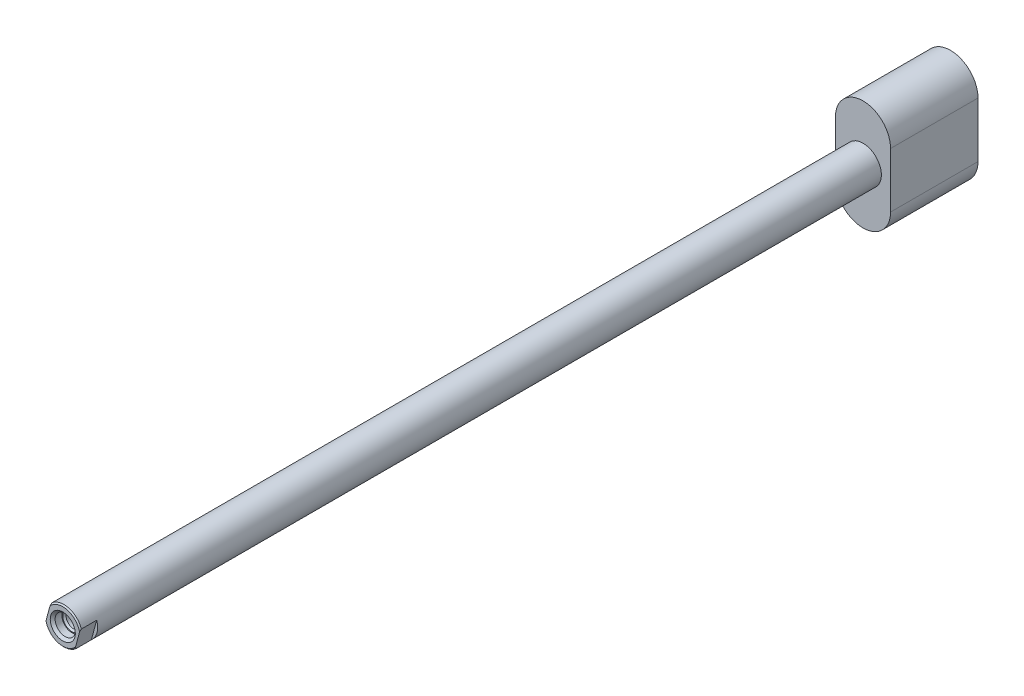
ISO-10303-21;
HEADER;
FILE_DESCRIPTION(('STEP AP214'),'2;1');
FILE_NAME('part.step','',(''),(''),'','','');
FILE_SCHEMA(('AUTOMOTIVE_DESIGN { 1 0 10303 214 1 1 1 1 }'));
ENDSEC;
DATA;
#1=APPLICATION_CONTEXT('core data for automotive mechanical design processes');
#2=APPLICATION_PROTOCOL_DEFINITION('international standard','automotive_design',2000,#1);
#3=PRODUCT_CONTEXT('',#1,'mechanical');
#4=PRODUCT('Part','Part','',(#3));
#5=PRODUCT_RELATED_PRODUCT_CATEGORY('part','',(#4));
#6=PRODUCT_DEFINITION_FORMATION('','',#4);
#7=PRODUCT_DEFINITION_CONTEXT('part definition',#1,'design');
#8=PRODUCT_DEFINITION('design','',#6,#7);
#9=PRODUCT_DEFINITION_SHAPE('','',#8);
#10=(LENGTH_UNIT() NAMED_UNIT(*) SI_UNIT(.MILLI.,.METRE.));
#11=(NAMED_UNIT(*) PLANE_ANGLE_UNIT() SI_UNIT($,.RADIAN.));
#12=(NAMED_UNIT(*) SI_UNIT($,.STERADIAN.) SOLID_ANGLE_UNIT());
#13=UNCERTAINTY_MEASURE_WITH_UNIT(LENGTH_MEASURE(1.E-05),#10,'distance_accuracy_value','');
#14=(GEOMETRIC_REPRESENTATION_CONTEXT(3) GLOBAL_UNCERTAINTY_ASSIGNED_CONTEXT((#13)) GLOBAL_UNIT_ASSIGNED_CONTEXT((#10,
#11,#12)) REPRESENTATION_CONTEXT('',''));
#15=CARTESIAN_POINT('',(0.,0.,0.));
#16=DIRECTION('',(0.,0.,1.));
#17=DIRECTION('',(1.,0.,0.));
#18=AXIS2_PLACEMENT_3D('',#15,#16,#17);
#19=CARTESIAN_POINT('',(0.,0.,7.));
#20=DIRECTION('',(0.,0.,1.));
#21=DIRECTION('',(1.,0.,0.));
#22=AXIS2_PLACEMENT_3D('',#19,#20,#21);
#23=PLANE('',#22);
#24=CARTESIAN_POINT('',(0.,0.,7.));
#25=DIRECTION('',(0.,0.,-1.));
#26=DIRECTION('',(-1.,0.,0.));
#27=AXIS2_PLACEMENT_3D('',#24,#25,#26);
#28=CIRCLE('',#27,2.05);
#29=CARTESIAN_POINT('',(-2.05,0.,7.));
#30=VERTEX_POINT('',#29);
#31=EDGE_CURVE('E217',#30,#30,#28,.T.);
#32=ORIENTED_EDGE('',*,*,#31,.T.);
#33=EDGE_LOOP('',(#32));
#34=FACE_BOUND('',#33,.T.);
#35=CARTESIAN_POINT('',(0.,0.,7.00000000000001));
#36=DIRECTION('',(0.,0.,-1.));
#37=DIRECTION('',(-1.,0.,0.));
#38=AXIS2_PLACEMENT_3D('',#35,#36,#37);
#39=CIRCLE('',#38,2.8);
#40=CARTESIAN_POINT('',(2.08845616765183,-1.8650337358335,7.00000000000001));
#41=VERTEX_POINT('',#40);
#42=CARTESIAN_POINT('',(-2.74117296379353,-0.570938510320872,7.00000000000001));
#43=VERTEX_POINT('',#42);
#44=EDGE_CURVE('E224',#41,#43,#39,.T.);
#45=ORIENTED_EDGE('',*,*,#44,.F.);
#46=DIRECTION('',(0.258819045102516,0.96592582628907,0.));
#47=VECTOR('',#46,1.);
#48=CARTESIAN_POINT('',(2.41481456572267,-0.647047612756289,7.));
#49=LINE('',#48,#47);
#50=CARTESIAN_POINT('',(2.74117296379352,0.570938510320919,7.00000000000001));
#51=VERTEX_POINT('',#50);
#52=EDGE_CURVE('E198',#41,#51,#49,.T.);
#53=ORIENTED_EDGE('',*,*,#52,.T.);
#54=CARTESIAN_POINT('',(-2.08845616765182,1.86503373583351,7.00000000000001));
#55=VERTEX_POINT('',#54);
#56=EDGE_CURVE('E225',#55,#51,#39,.T.);
#57=ORIENTED_EDGE('',*,*,#56,.F.);
#58=DIRECTION('',(-0.258819045102527,-0.965925826289067,0.));
#59=VECTOR('',#58,1.);
#60=CARTESIAN_POINT('',(-2.41481456572267,0.647047612756318,7.));
#61=LINE('',#60,#59);
#62=EDGE_CURVE('E169',#55,#43,#61,.T.);
#63=ORIENTED_EDGE('',*,*,#62,.T.);
#64=EDGE_LOOP('',(#45,#53,#57,#63));
#65=FACE_BOUND('',#64,.T.);
#66=ADVANCED_FACE('F38',(#34,#65),#23,.T.);
#67=CARTESIAN_POINT('',(0.,0.,6.8));
#68=DIRECTION('',(0.,0.,-1.));
#69=DIRECTION('',(-1.,0.,0.));
#70=AXIS2_PLACEMENT_3D('',#67,#68,#69);
#71=CONICAL_SURFACE('',#70,3.,0.785398163397434);
#72=CARTESIAN_POINT('',(0.,0.,6.8));
#73=DIRECTION('',(0.,0.,-1.));
#74=DIRECTION('',(-1.,0.,0.));
#75=AXIS2_PLACEMENT_3D('',#72,#73,#74);
#76=CIRCLE('',#75,3.);
#77=CARTESIAN_POINT('',(1.98561173512111,-2.24885438331372,6.8));
#78=VERTEX_POINT('',#77);
#79=CARTESIAN_POINT('',(-2.84401739632425,-0.954759157801095,6.8));
#80=VERTEX_POINT('',#79);
#81=EDGE_CURVE('E220',#78,#80,#76,.T.);
#82=ORIENTED_EDGE('',*,*,#81,.F.);
#83=CARTESIAN_POINT('',(0.789141781179332,-6.71414104115412,3.03964241542546));
#84=CARTESIAN_POINT('',(0.838397517213514,-6.53031613171035,3.21640923359223));
#85=CARTESIAN_POINT('',(0.887783419505345,-6.3460054351796,3.39264257243609));
#86=CARTESIAN_POINT('',(0.986935495776662,-5.97596484885909,3.74358903229317));
#87=CARTESIAN_POINT('',(1.03670175133417,-5.790234654616,3.91830180895357));
#88=CARTESIAN_POINT('',(1.13702323850811,-5.41582976739199,4.26675358800921));
#89=CARTESIAN_POINT('',(1.18758145010516,-5.22714395297196,4.44047981242431));
#90=CARTESIAN_POINT('',(1.289350829023,-4.84733546019587,4.78501639471897));
#91=CARTESIAN_POINT('',(1.34056191665286,-4.65621307925037,4.95582710262882));
#92=CARTESIAN_POINT('',(1.43343554839668,-4.30960396689897,5.25905373681237));
#93=CARTESIAN_POINT('',(1.47492998271965,-4.15474462977432,5.39223558142514));
#94=CARTESIAN_POINT('',(1.55871782857579,-3.84204413198246,5.65489065982897));
#95=CARTESIAN_POINT('',(1.60101143922773,-3.68420222819387,5.78436294859514));
#96=CARTESIAN_POINT('',(1.68662395520783,-3.36469196879233,6.03775455912755));
#97=CARTESIAN_POINT('',(1.72994143454289,-3.20302893505806,6.1616809802294));
#98=CARTESIAN_POINT('',(1.79603744638248,-2.95635526069505,6.34136253750564));
#99=CARTESIAN_POINT('',(1.81825182234145,-2.8734500809577,6.4002112827069));
#100=CARTESIAN_POINT('',(1.86312841307552,-2.70596836426768,6.51529392508184));
#101=CARTESIAN_POINT('',(1.88579057432912,-2.62139202705996,6.57152813209603));
#102=CARTESIAN_POINT('',(1.93037492634035,-2.45500096013149,6.67765541513886));
#103=CARTESIAN_POINT('',(1.95226847922813,-2.37329310839611,6.72772720282106));
#104=CARTESIAN_POINT('',(1.99660188832648,-2.20783857316833,6.82410409391317));
#105=CARTESIAN_POINT('',(2.01904162123841,-2.1240923498327,6.87041003739094));
#106=CARTESIAN_POINT('',(2.06454017836192,-1.95428942297671,6.95820900147921));
#107=CARTESIAN_POINT('',(2.08759881219084,-1.86823342997406,6.99970348173362));
#108=CARTESIAN_POINT('',(2.13439574554934,-1.69358489704169,7.0765488922833));
#109=CARTESIAN_POINT('',(2.15813386084004,-1.60499304470088,7.11190146989363));
#110=CARTESIAN_POINT('',(2.2011134687884,-1.4445909641482,7.16807570100878));
#111=CARTESIAN_POINT('',(2.22022374423078,-1.3732704452506,7.19038724798994));
#112=CARTESIAN_POINT('',(2.25882310811057,-1.2292156581114,7.22938161628565));
#113=CARTESIAN_POINT('',(2.27831205257995,-1.15648192716575,7.24606653418168));
#114=CARTESIAN_POINT('',(2.31752447971826,-1.01013915679749,7.27299258471795));
#115=CARTESIAN_POINT('',(2.33724698812957,-0.936533753353795,7.28325459129994));
#116=CARTESIAN_POINT('',(2.37685265169716,-0.788723404652068,7.29686018342851));
#117=CARTESIAN_POINT('',(2.39673579652218,-0.714518497950846,7.30020421040174));
#118=CARTESIAN_POINT('',(2.43656165425419,-0.565886373439954,7.29977570762936));
#119=CARTESIAN_POINT('',(2.45650435044684,-0.491459218009062,7.29597998357619));
#120=CARTESIAN_POINT('',(2.49621829518581,-0.343244758474241,7.28145171601451));
#121=CARTESIAN_POINT('',(2.51598953040683,-0.269457504101012,7.27071863817115));
#122=CARTESIAN_POINT('',(2.55528788473654,-0.122794049088692,7.24285670280215));
#123=CARTESIAN_POINT('',(2.57481403908634,-0.0499214489787897,7.22570781171165));
#124=CARTESIAN_POINT('',(2.61347429336991,0.0943605842410244,7.18581354261193));
#125=CARTESIAN_POINT('',(2.63260837131049,0.165769935271238,7.1630678515809));
#126=CARTESIAN_POINT('',(2.6929491629719,0.390964835520553,7.08297957029656));
#127=CARTESIAN_POINT('',(2.73335702317498,0.541769022823605,7.01665147928317));
#128=CARTESIAN_POINT('',(2.81230341121237,0.836400954053188,6.86900675029796));
#129=CARTESIAN_POINT('',(2.85083803097216,0.980214112847082,6.78766034416172));
#130=CARTESIAN_POINT('',(2.92687698758543,1.26399536228234,6.61407653249033));
#131=CARTESIAN_POINT('',(2.96436171622465,1.40389027407184,6.52171258296883));
#132=CARTESIAN_POINT('',(3.03811249392869,1.67913192356105,6.33034532729569));
#133=CARTESIAN_POINT('',(3.07437960764994,1.81448263461261,6.2313480607834));
#134=CARTESIAN_POINT('',(3.15275526086664,2.10698455449374,6.00965769149262));
#135=CARTESIAN_POINT('',(3.19468122764531,2.26345439266819,5.88600688495277));
#136=CARTESIAN_POINT('',(3.27762989665291,2.57302303982477,5.63424527012019));
#137=CARTESIAN_POINT('',(3.31865245019872,2.72612129391395,5.50613373650783));
#138=CARTESIAN_POINT('',(3.40006333729751,3.02995086085589,5.24663457785289));
#139=CARTESIAN_POINT('',(3.44045100278819,3.18067968046623,5.11524383513361));
#140=CARTESIAN_POINT('',(3.52071571438991,3.48023166221869,4.85015280105799));
#141=CARTESIAN_POINT('',(3.5605927464918,3.62905477207801,4.71645244657325));
#142=CARTESIAN_POINT('',(3.63752944144516,3.91618642661041,4.45552729076419));
#143=CARTESIAN_POINT('',(3.67461251147061,4.05458232804602,4.32840531548355));
#144=CARTESIAN_POINT('',(3.74850086297947,4.3303374099646,4.07295676813054));
#145=CARTESIAN_POINT('',(3.78530613817051,4.4676965669641,3.94463016891887));
#146=CARTESIAN_POINT('',(3.85861303546447,4.74128163221039,3.68729647622875));
#147=CARTESIAN_POINT('',(3.89511513888303,4.87750933675159,3.55829142712567));
#148=CARTESIAN_POINT('',(3.96793184525992,5.14926498458997,3.29950659839391));
#149=CARTESIAN_POINT('',(4.00424645688661,5.28479296023793,3.16972685519101));
#150=CARTESIAN_POINT('',(4.04048735026601,5.42004581564154,3.03964241542546));
#151=B_SPLINE_CURVE_WITH_KNOTS('',3,(#83,#84,#85,#86,#87,#88,#89,#90,#91,#92,#93,#94,#95,#96,
#97,#98,#99,#100,#101,#102,#103,#104,#105,#106,#107,#108,#109,#110,#111,#112,#113,#114,#115,
#116,#117,#118,#119,#120,#121,#122,#123,#124,#125,#126,#127,#128,#129,#130,#131,#132,#133,#134,
#135,#136,#137,#138,#139,#140,#141,#142,#143,#144,#145,#146,#147,#148,#149,#150),.UNSPECIFIED.,
.F.,.F.,(4,2,2,2,2,2,2,2,2,2,2,2,2,2,2,2,2,2,2,2,2,2,2,2,2,2,2,2,2,2,2,2,2,4),(0.,
0.779223553856486,1.55861920750734,2.34285322232984,3.12699241197525,3.75222332878767,
4.37761213453372,5.00217602568833,5.31434120448593,5.62646929480658,5.92129167276348,
6.21604810161056,6.5107148755434,6.80530249470207,7.03651785485177,7.2676469646278,
7.49802096909811,7.72838027327083,7.95948921901828,8.19061596756039,8.42247052276505,
8.65433804824393,9.16182646559973,9.67033180325825,10.1853729811453,10.6999514239144,
11.3112003235981,11.9225490815444,12.5345030562137,13.1464737839155,13.7210934160895,
14.2957260252404,14.8691287182088,15.4425046591184),.UNSPECIFIED.);
#152=EDGE_CURVE('E199',#78,#41,#151,.T.);
#153=ORIENTED_EDGE('',*,*,#152,.T.);
#154=ORIENTED_EDGE('',*,*,#44,.T.);
#155=CARTESIAN_POINT('',(-0.80005872580309,6.6733984491546,3.07881403129521));
#156=CARTESIAN_POINT('',(-0.848858475223293,6.49127530492178,3.2537821794811));
#157=CARTESIAN_POINT('',(-0.89778834497944,6.30866654498411,3.42821655912551));
#158=CARTESIAN_POINT('',(-0.996027348016984,5.9420335943631,3.7755666105796));
#159=CARTESIAN_POINT('',(-1.04533656240787,5.75800910097502,3.9484819396538));
#160=CARTESIAN_POINT('',(-1.14473442987697,5.38705120941634,4.29331483969953));
#161=CARTESIAN_POINT('',(-1.19482600380679,5.20010691047918,4.46521987141103));
#162=CARTESIAN_POINT('',(-1.29565879161439,4.82379382331239,4.80612579108504));
#163=CARTESIAN_POINT('',(-1.34639992716168,4.63442532741616,4.9751270235652));
#164=CARTESIAN_POINT('',(-1.4384339458764,4.29094969354812,5.27515910185036));
#165=CARTESIAN_POINT('',(-1.47956009465234,4.13746481679666,5.40695076060845));
#166=CARTESIAN_POINT('',(-1.56260426808076,3.82753974228925,5.66685069452284));
#167=CARTESIAN_POINT('',(-1.6045224861725,3.67109882260813,5.79495805011819));
#168=CARTESIAN_POINT('',(-1.68937539761451,3.35442344593641,6.04567815006513));
#169=CARTESIAN_POINT('',(-1.73230874313051,3.19419401913178,6.16829761666827));
#170=CARTESIAN_POINT('',(-1.79781336187915,2.94972745383143,6.34609438871697));
#171=CARTESIAN_POINT('',(-1.81982820787434,2.86756693005661,6.40432781871428));
#172=CARTESIAN_POINT('',(-1.86429887659626,2.70160013493982,6.51821651503946));
#173=CARTESIAN_POINT('',(-1.88675464782181,2.61779405580294,6.57387207994775));
#174=CARTESIAN_POINT('',(-1.93115502434801,2.45208959473198,6.6794638844525));
#175=CARTESIAN_POINT('',(-1.95307641278399,2.37027785931643,6.729545126368));
#176=CARTESIAN_POINT('',(-1.99746752455282,2.20460797479071,6.82592198882995));
#177=CARTESIAN_POINT('',(-2.01993712342139,2.1207502901875,6.87221845846527));
#178=CARTESIAN_POINT('',(-2.06549670951452,1.95071960011616,6.95997115365653));
#179=CARTESIAN_POINT('',(-2.08858648109264,1.86454739945145,7.00142903555533));
#180=CARTESIAN_POINT('',(-2.13544748141365,1.68965976535992,7.07816776522391));
#181=CARTESIAN_POINT('',(-2.159218522204,1.60094503338156,7.11345029795337));
#182=CARTESIAN_POINT('',(-2.2022187696218,1.4404659252803,7.1694121117036));
#183=CARTESIAN_POINT('',(-2.22131576562091,1.3691949659397,7.19159906912916));
#184=CARTESIAN_POINT('',(-2.25988658787187,1.2252466976094,7.2303412484838));
#185=CARTESIAN_POINT('',(-2.27936027092931,1.15256992302856,7.24689856767324));
#186=CARTESIAN_POINT('',(-2.3185400548824,1.00634897868606,7.2735721121564));
#187=CARTESIAN_POINT('',(-2.33824519727922,0.932808386090734,7.28370905111433));
#188=CARTESIAN_POINT('',(-2.37781323757585,0.785138449347792,7.29707303273412));
#189=CARTESIAN_POINT('',(-2.39767612556128,0.711009142201099,7.30030050626224));
#190=CARTESIAN_POINT('',(-2.43745643050283,0.56254702301866,7.2996542856907));
#191=CARTESIAN_POINT('',(-2.45737382303226,0.488214302144535,7.29575828164155));
#192=CARTESIAN_POINT('',(-2.49703540751257,0.340195253755343,7.28105217232633));
#193=CARTESIAN_POINT('',(-2.51677958590858,0.266508976827733,7.27024153076257));
#194=CARTESIAN_POINT('',(-2.55602295180507,0.120050741442031,7.24224887096265));
#195=CARTESIAN_POINT('',(-2.57552117445214,0.0472823838658622,7.22504693760949));
#196=CARTESIAN_POINT('',(-2.61412580291196,-0.0967920509534981,7.18506992728901));
#197=CARTESIAN_POINT('',(-2.63323218775076,-0.168098049920882,7.16229455283105));
#198=CARTESIAN_POINT('',(-2.69364981007442,-0.393579686105261,7.08192630964776));
#199=CARTESIAN_POINT('',(-2.73415587249319,-0.544750369066651,7.01529684974855));
#200=CARTESIAN_POINT('',(-2.81329112558873,-0.840087154289045,6.86701630221313));
#201=CARTESIAN_POINT('',(-2.85191637166261,-0.984238535091609,6.78533522923649));
#202=CARTESIAN_POINT('',(-2.92813096616304,-1.26867527404545,6.61107172871542));
#203=CARTESIAN_POINT('',(-2.96570075513789,-1.40888763532925,6.51836327008227));
#204=CARTESIAN_POINT('',(-3.03961947625018,-1.6847560581508,6.32630533036219));
#205=CARTESIAN_POINT('',(-3.07596947895719,-1.82041611510862,6.22696191445466));
#206=CARTESIAN_POINT('',(-3.15379814592717,-2.11087665452594,6.0065724938841));
#207=CARTESIAN_POINT('',(-3.19511521803658,-2.26507406685827,5.88467982088621));
#208=CARTESIAN_POINT('',(-3.27687112592502,-2.57019126891681,5.63655801544816));
#209=CARTESIAN_POINT('',(-3.31730982397866,-2.72111054464497,5.51032821086142));
#210=CARTESIAN_POINT('',(-3.3975675770924,-3.02063655696672,5.25467103617285));
#211=CARTESIAN_POINT('',(-3.43738599686865,-3.16924092264879,5.12524069936245));
#212=CARTESIAN_POINT('',(-3.51652270278561,-3.46458312987454,4.86411583822898));
#213=CARTESIAN_POINT('',(-3.55584097558139,-3.61132092161422,4.73242125371074));
#214=CARTESIAN_POINT('',(-3.63174645330963,-3.89460402106881,4.47525935391749));
#215=CARTESIAN_POINT('',(-3.66835622799293,-4.03123356024053,4.3498912902552));
#216=CARTESIAN_POINT('',(-3.74130160842774,-4.30346942620068,4.09796527789533));
#217=CARTESIAN_POINT('',(-3.7776372082238,-4.43907573076306,3.97140730348461));
#218=CARTESIAN_POINT('',(-3.85001036299173,-4.709176021461,3.71760962990355));
#219=CARTESIAN_POINT('',(-3.88604838117659,-4.84367173633097,3.59037190023107));
#220=CARTESIAN_POINT('',(-3.95793878346893,-5.11197037026255,3.33512833107673));
#221=CARTESIAN_POINT('',(-3.99379117596579,-5.24577332063372,3.20712252688266));
#222=CARTESIAN_POINT('',(-4.02957040564224,-5.37930322364193,3.07881403129525));
#223=B_SPLINE_CURVE_WITH_KNOTS('',3,(#155,#156,#157,#158,#159,#160,#161,#162,#163,#164,#165,
#166,#167,#168,#169,#170,#171,#172,#173,#174,#175,#176,#177,#178,#179,#180,#181,#182,#183,#184,
#185,#186,#187,#188,#189,#190,#191,#192,#193,#194,#195,#196,#197,#198,#199,#200,#201,#202,#203,
#204,#205,#206,#207,#208,#209,#210,#211,#212,#213,#214,#215,#216,#217,#218,#219,#220,#221,#222),
.UNSPECIFIED.,.F.,.F.,(4,2,2,2,2,2,2,2,2,2,2,2,2,2,2,2,2,2,2,2,2,2,2,2,2,2,2,2,2,2,2,2,2,4),(0.,
0.771678771001828,1.54352739700443,2.32008895704142,3.09655773768907,3.71584043587386,
4.33527638182,4.95393154806733,5.26314605371531,5.57232465466761,5.86743848396912,
6.16248592368375,6.45743206481728,6.7522976032629,6.98325736525403,7.21413099118761,
7.4442559183441,7.67436649475811,7.90519898704662,8.13604938482119,8.36762522353221,
8.59921342564175,9.10809714100835,9.61800581869265,10.1344341735543,10.6503967442365,
11.2528414403787,11.8553799252216,12.4584995754038,13.0616352844315,13.6286593669099,
14.1956957306761,14.7615507962676,15.3273800607446),.UNSPECIFIED.);
#224=EDGE_CURVE('E161',#43,#80,#223,.T.);
#225=ORIENTED_EDGE('',*,*,#224,.T.);
#226=EDGE_LOOP('',(#82,#153,#154,#225));
#227=FACE_BOUND('',#226,.T.);
#228=ADVANCED_FACE('F172',(#227),#71,.T.);
#229=ORIENTED_EDGE('',*,*,#56,.T.);
#230=CARTESIAN_POINT('',(2.84401739632423,0.954759157801142,6.8));
#231=VERTEX_POINT('',#230);
#232=EDGE_CURVE('E191',#51,#231,#151,.T.);
#233=ORIENTED_EDGE('',*,*,#232,.T.);
#234=CARTESIAN_POINT('',(-1.9856117351211,2.24885438331373,6.8));
#235=VERTEX_POINT('',#234);
#236=EDGE_CURVE('E221',#235,#231,#76,.T.);
#237=ORIENTED_EDGE('',*,*,#236,.F.);
#238=EDGE_CURVE('E170',#235,#55,#223,.T.);
#239=ORIENTED_EDGE('',*,*,#238,.T.);
#240=EDGE_LOOP('',(#229,#233,#237,#239));
#241=FACE_BOUND('',#240,.T.);
#242=ADVANCED_FACE('F247',(#241),#71,.T.);
#243=CARTESIAN_POINT('',(0.,0.,-138.15));
#244=DIRECTION('',(0.,0.,-1.));
#245=DIRECTION('',(-1.,0.,0.));
#246=AXIS2_PLACEMENT_3D('',#243,#244,#245);
#247=CYLINDRICAL_SURFACE('',#246,3.);
#248=CARTESIAN_POINT('',(0.,0.,-123.85));
#249=DIRECTION('',(0.,0.,1.));
#250=DIRECTION('',(1.,0.,0.));
#251=AXIS2_PLACEMENT_3D('',#248,#249,#250);
#252=CIRCLE('',#251,3.);
#253=CARTESIAN_POINT('',(3.,0.,-123.85));
#254=VERTEX_POINT('',#253);
#255=EDGE_CURVE('E11',#254,#254,#252,.F.);
#256=ORIENTED_EDGE('',*,*,#255,.F.);
#257=EDGE_LOOP('',(#256));
#258=FACE_BOUND('',#257,.T.);
#259=CARTESIAN_POINT('',(0.,0.,4.3));
#260=DIRECTION('',(0.,0.,1.));
#261=DIRECTION('',(1.,0.,0.));
#262=AXIS2_PLACEMENT_3D('',#259,#260,#261);
#263=CIRCLE('',#262,3.);
#264=CARTESIAN_POINT('',(-2.84401739632425,-0.954759157801097,4.3));
#265=VERTEX_POINT('',#264);
#266=CARTESIAN_POINT('',(-1.9856117351211,2.24885438331373,4.3));
#267=VERTEX_POINT('',#266);
#268=EDGE_CURVE('E232',#265,#267,#263,.F.);
#269=ORIENTED_EDGE('',*,*,#268,.T.);
#270=DIRECTION('',(0.,0.,-1.));
#271=VECTOR('',#270,1.);
#272=CARTESIAN_POINT('',(-1.9856117351211,2.24885438331373,-138.15));
#273=LINE('',#272,#271);
#274=EDGE_CURVE('E45',#267,#235,#273,.F.);
#275=ORIENTED_EDGE('',*,*,#274,.T.);
#276=ORIENTED_EDGE('',*,*,#236,.T.);
#277=DIRECTION('',(0.,0.,-1.));
#278=VECTOR('',#277,1.);
#279=CARTESIAN_POINT('',(2.84401739632423,0.954759157801142,-138.15));
#280=LINE('',#279,#278);
#281=CARTESIAN_POINT('',(2.84401739632423,0.954759157801142,4.3));
#282=VERTEX_POINT('',#281);
#283=EDGE_CURVE('E231',#231,#282,#280,.T.);
#284=ORIENTED_EDGE('',*,*,#283,.T.);
#285=CARTESIAN_POINT('',(1.98561173512111,-2.24885438331372,4.3));
#286=VERTEX_POINT('',#285);
#287=EDGE_CURVE('E228',#282,#286,#263,.F.);
#288=ORIENTED_EDGE('',*,*,#287,.T.);
#289=DIRECTION('',(0.,0.,-1.));
#290=VECTOR('',#289,1.);
#291=CARTESIAN_POINT('',(1.98561173512111,-2.24885438331372,-138.15));
#292=LINE('',#291,#290);
#293=EDGE_CURVE('E235',#286,#78,#292,.F.);
#294=ORIENTED_EDGE('',*,*,#293,.T.);
#295=ORIENTED_EDGE('',*,*,#81,.T.);
#296=DIRECTION('',(0.,0.,-1.));
#297=VECTOR('',#296,1.);
#298=CARTESIAN_POINT('',(-2.84401739632425,-0.954759157801095,-138.15));
#299=LINE('',#298,#297);
#300=EDGE_CURVE('E238',#80,#265,#299,.T.);
#301=ORIENTED_EDGE('',*,*,#300,.T.);
#302=EDGE_LOOP('',(#269,#275,#276,#284,#288,#294,#295,#301));
#303=FACE_BOUND('',#302,.T.);
#304=ADVANCED_FACE('F244',(#258,#303),#247,.T.);
#305=CARTESIAN_POINT('',(0.,0.,6.6));
#306=DIRECTION('',(0.,0.,1.));
#307=DIRECTION('',(1.,0.,0.));
#308=AXIS2_PLACEMENT_3D('',#305,#306,#307);
#309=CONICAL_SURFACE('',#308,1.65,0.785398163397449);
#310=ORIENTED_EDGE('',*,*,#31,.F.);
#311=EDGE_LOOP('',(#310));
#312=FACE_BOUND('',#311,.T.);
#313=CARTESIAN_POINT('',(0.,0.,6.6));
#314=DIRECTION('',(0.,0.,-1.));
#315=DIRECTION('',(-1.,0.,0.));
#316=AXIS2_PLACEMENT_3D('',#313,#314,#315);
#317=CIRCLE('',#316,1.65);
#318=CARTESIAN_POINT('',(-1.65,0.,6.6));
#319=VERTEX_POINT('',#318);
#320=EDGE_CURVE('E214',#319,#319,#317,.T.);
#321=ORIENTED_EDGE('',*,*,#320,.T.);
#322=EDGE_LOOP('',(#321));
#323=FACE_BOUND('',#322,.T.);
#324=ADVANCED_FACE('F271',(#312,#323),#309,.F.);
#325=CARTESIAN_POINT('',(0.,0.,-4.7098521559686));
#326=DIRECTION('',(0.,0.,-1.));
#327=DIRECTION('',(-1.,0.,0.));
#328=AXIS2_PLACEMENT_3D('',#325,#326,#327);
#329=CYLINDRICAL_SURFACE('',#328,1.65);
#330=ORIENTED_EDGE('',*,*,#320,.F.);
#331=EDGE_LOOP('',(#330));
#332=FACE_BOUND('',#331,.T.);
#333=CARTESIAN_POINT('',(0.,0.,5.5));
#334=DIRECTION('',(0.,0.,-1.));
#335=DIRECTION('',(-1.,0.,0.));
#336=AXIS2_PLACEMENT_3D('',#333,#334,#335);
#337=CIRCLE('',#336,1.65);
#338=CARTESIAN_POINT('',(-1.65,0.,5.5));
#339=VERTEX_POINT('',#338);
#340=EDGE_CURVE('E211',#339,#339,#337,.T.);
#341=ORIENTED_EDGE('',*,*,#340,.T.);
#342=EDGE_LOOP('',(#341));
#343=FACE_BOUND('',#342,.T.);
#344=ADVANCED_FACE('F274',(#332,#343),#329,.F.);
#345=CARTESIAN_POINT('',(0.,1.65,5.5));
#346=DIRECTION('',(0.,0.,-1.));
#347=DIRECTION('',(-1.,0.,0.));
#348=AXIS2_PLACEMENT_3D('',#345,#346,#347);
#349=PLANE('',#348);
#350=ORIENTED_EDGE('',*,*,#340,.F.);
#351=EDGE_LOOP('',(#350));
#352=FACE_BOUND('',#351,.T.);
#353=CARTESIAN_POINT('',(0.,0.,5.5));
#354=DIRECTION('',(0.,0.,-1.));
#355=DIRECTION('',(-1.,0.,0.));
#356=AXIS2_PLACEMENT_3D('',#353,#354,#355);
#357=CIRCLE('',#356,1.5);
#358=CARTESIAN_POINT('',(-1.5,0.,5.5));
#359=VERTEX_POINT('',#358);
#360=EDGE_CURVE('E208',#359,#359,#357,.T.);
#361=ORIENTED_EDGE('',*,*,#360,.T.);
#362=EDGE_LOOP('',(#361));
#363=FACE_BOUND('',#362,.T.);
#364=ADVANCED_FACE('F280',(#352,#363),#349,.F.);
#365=CARTESIAN_POINT('',(0.,0.,5.2295));
#366=DIRECTION('',(0.,0.,1.));
#367=DIRECTION('',(1.,0.,0.));
#368=AXIS2_PLACEMENT_3D('',#365,#366,#367);
#369=CONICAL_SURFACE('',#368,1.2295,0.785398163397448);
#370=ORIENTED_EDGE('',*,*,#360,.F.);
#371=EDGE_LOOP('',(#370));
#372=FACE_BOUND('',#371,.T.);
#373=CARTESIAN_POINT('',(0.,0.,5.2295));
#374=DIRECTION('',(0.,0.,-1.));
#375=DIRECTION('',(-1.,0.,0.));
#376=AXIS2_PLACEMENT_3D('',#373,#374,#375);
#377=CIRCLE('',#376,1.2295);
#378=CARTESIAN_POINT('',(-1.2295,0.,5.2295));
#379=VERTEX_POINT('',#378);
#380=EDGE_CURVE('E205',#379,#379,#377,.T.);
#381=ORIENTED_EDGE('',*,*,#380,.T.);
#382=EDGE_LOOP('',(#381));
#383=FACE_BOUND('',#382,.T.);
#384=ADVANCED_FACE('F286',(#372,#383),#369,.F.);
#385=CARTESIAN_POINT('',(0.,0.,-4.7098521559686));
#386=DIRECTION('',(0.,0.,-1.));
#387=DIRECTION('',(-1.,0.,0.));
#388=AXIS2_PLACEMENT_3D('',#385,#386,#387);
#389=CYLINDRICAL_SURFACE('',#388,1.2295);
#390=ORIENTED_EDGE('',*,*,#380,.F.);
#391=EDGE_LOOP('',(#390));
#392=FACE_BOUND('',#391,.T.);
#393=CARTESIAN_POINT('',(0.,0.,-4.));
#394=DIRECTION('',(0.,0.,-1.));
#395=DIRECTION('',(-1.,0.,0.));
#396=AXIS2_PLACEMENT_3D('',#393,#394,#395);
#397=CIRCLE('',#396,1.2295);
#398=CARTESIAN_POINT('',(-1.2295,0.,-4.));
#399=VERTEX_POINT('',#398);
#400=EDGE_CURVE('E202',#399,#399,#397,.T.);
#401=ORIENTED_EDGE('',*,*,#400,.T.);
#402=EDGE_LOOP('',(#401));
#403=FACE_BOUND('',#402,.T.);
#404=ADVANCED_FACE('F261',(#392,#403),#389,.F.);
#405=CARTESIAN_POINT('',(0.,0.,-4.7098521559686));
#406=DIRECTION('',(0.,0.,1.));
#407=DIRECTION('',(1.,0.,0.));
#408=AXIS2_PLACEMENT_3D('',#405,#406,#407);
#409=CONICAL_SURFACE('',#408,0.,1.04719755119662);
#410=ORIENTED_EDGE('',*,*,#400,.F.);
#411=EDGE_LOOP('',(#410));
#412=FACE_BOUND('',#411,.T.);
#413=CARTESIAN_POINT('',(0.,0.,-4.7098521559686));
#414=VERTEX_POINT('',#413);
#415=VERTEX_LOOP('',#414);
#416=FACE_BOUND('',#415,.T.);
#417=ADVANCED_FACE('F189',(#412,#416),#409,.F.);
#418=CARTESIAN_POINT('',(0.,0.,4.3));
#419=DIRECTION('',(0.,0.,1.));
#420=DIRECTION('',(1.,0.,0.));
#421=AXIS2_PLACEMENT_3D('',#418,#419,#420);
#422=PLANE('',#421);
#423=DIRECTION('',(-0.258819045102516,-0.965925826289069,0.));
#424=VECTOR('',#423,1.);
#425=CARTESIAN_POINT('',(3.3853859848571,2.9751742358277,4.3));
#426=LINE('',#425,#424);
#427=EDGE_CURVE('E58',#282,#286,#426,.T.);
#428=ORIENTED_EDGE('',*,*,#427,.T.);
#429=ORIENTED_EDGE('',*,*,#287,.F.);
#430=EDGE_LOOP('',(#428,#429));
#431=FACE_BOUND('',#430,.T.);
#432=ADVANCED_FACE('F182',(#431),#422,.T.);
#433=CARTESIAN_POINT('',(3.3853859848571,2.9751742358277,7.6));
#434=DIRECTION('',(0.965925826289069,-0.258819045102516,0.));
#435=DIRECTION('',(0.258819045102516,0.96592582628907,0.));
#436=AXIS2_PLACEMENT_3D('',#433,#434,#435);
#437=PLANE('',#436);
#438=ORIENTED_EDGE('',*,*,#427,.F.);
#439=ORIENTED_EDGE('',*,*,#283,.F.);
#440=ORIENTED_EDGE('',*,*,#232,.F.);
#441=ORIENTED_EDGE('',*,*,#52,.F.);
#442=ORIENTED_EDGE('',*,*,#152,.F.);
#443=ORIENTED_EDGE('',*,*,#293,.F.);
#444=EDGE_LOOP('',(#438,#439,#440,#441,#442,#443));
#445=FACE_BOUND('',#444,.T.);
#446=ADVANCED_FACE('F184',(#445),#437,.T.);
#447=DIRECTION('',(0.258819045102527,0.965925826289067,0.));
#448=VECTOR('',#447,1.);
#449=CARTESIAN_POINT('',(-3.7089097912353,-4.182581518689,4.3));
#450=LINE('',#449,#448);
#451=EDGE_CURVE('E51',#265,#267,#450,.T.);
#452=ORIENTED_EDGE('',*,*,#451,.T.);
#453=ORIENTED_EDGE('',*,*,#268,.F.);
#454=EDGE_LOOP('',(#452,#453));
#455=FACE_BOUND('',#454,.T.);
#456=ADVANCED_FACE('F180',(#455),#422,.T.);
#457=CARTESIAN_POINT('',(-3.7089097912353,-4.182581518689,7.6));
#458=DIRECTION('',(-0.965925826289067,0.258819045102527,0.));
#459=DIRECTION('',(-0.258819045102527,-0.965925826289067,0.));
#460=AXIS2_PLACEMENT_3D('',#457,#458,#459);
#461=PLANE('',#460);
#462=ORIENTED_EDGE('',*,*,#451,.F.);
#463=ORIENTED_EDGE('',*,*,#300,.F.);
#464=ORIENTED_EDGE('',*,*,#224,.F.);
#465=ORIENTED_EDGE('',*,*,#62,.F.);
#466=ORIENTED_EDGE('',*,*,#238,.F.);
#467=ORIENTED_EDGE('',*,*,#274,.F.);
#468=EDGE_LOOP('',(#462,#463,#464,#465,#466,#467));
#469=FACE_BOUND('',#468,.T.);
#470=ADVANCED_FACE('F175',(#469),#461,.T.);
#471=CARTESIAN_POINT('',(-1.196959198424E-13,-4.50000000000012,-123.85));
#472=DIRECTION('',(0.,0.,-1.));
#473=DIRECTION('',(-1.,0.,0.));
#474=AXIS2_PLACEMENT_3D('',#471,#472,#473);
#475=CYLINDRICAL_SURFACE('',#474,4.5);
#476=CARTESIAN_POINT('',(-1.196959198424E-13,-4.50000000000012,-138.15));
#477=DIRECTION('',(0.,0.,1.));
#478=DIRECTION('',(1.,0.,0.));
#479=AXIS2_PLACEMENT_3D('',#476,#477,#478);
#480=CIRCLE('',#479,4.5);
#481=CARTESIAN_POINT('',(-4.5,-4.5,-138.15));
#482=VERTEX_POINT('',#481);
#483=CARTESIAN_POINT('',(4.5,-4.5,-138.15));
#484=VERTEX_POINT('',#483);
#485=EDGE_CURVE('E132',#482,#484,#480,.T.);
#486=ORIENTED_EDGE('',*,*,#485,.T.);
#487=DIRECTION('',(0.,0.,-1.));
#488=VECTOR('',#487,1.);
#489=CARTESIAN_POINT('',(4.5,-4.5,-123.85));
#490=LINE('',#489,#488);
#491=CARTESIAN_POINT('',(4.5,-4.5,-123.85));
#492=VERTEX_POINT('',#491);
#493=EDGE_CURVE('E130',#492,#484,#490,.T.);
#494=ORIENTED_EDGE('',*,*,#493,.F.);
#495=CARTESIAN_POINT('',(-1.196959198424E-13,-4.50000000000012,-123.85));
#496=DIRECTION('',(0.,0.,1.));
#497=DIRECTION('',(1.,0.,0.));
#498=AXIS2_PLACEMENT_3D('',#495,#496,#497);
#499=CIRCLE('',#498,4.49999999999988);
#500=CARTESIAN_POINT('',(-4.5,-4.5,-123.85));
#501=VERTEX_POINT('',#500);
#502=EDGE_CURVE('E116',#501,#492,#499,.T.);
#503=ORIENTED_EDGE('',*,*,#502,.F.);
#504=DIRECTION('',(0.,0.,-1.));
#505=VECTOR('',#504,1.);
#506=CARTESIAN_POINT('',(-4.5,-4.5,-123.85));
#507=LINE('',#506,#505);
#508=EDGE_CURVE('E146',#501,#482,#507,.T.);
#509=ORIENTED_EDGE('',*,*,#508,.T.);
#510=EDGE_LOOP('',(#486,#494,#503,#509));
#511=FACE_BOUND('',#510,.T.);
#512=ADVANCED_FACE('F131',(#511),#475,.T.);
#513=CARTESIAN_POINT('',(4.5,-4.5,-123.85));
#514=DIRECTION('',(-1.,0.,0.));
#515=DIRECTION('',(0.,0.,1.));
#516=AXIS2_PLACEMENT_3D('',#513,#514,#515);
#517=PLANE('',#516);
#518=DIRECTION('',(0.,1.,0.));
#519=VECTOR('',#518,1.);
#520=CARTESIAN_POINT('',(4.5,-4.5,-138.15));
#521=LINE('',#520,#519);
#522=CARTESIAN_POINT('',(4.5,4.5,-138.15));
#523=VERTEX_POINT('',#522);
#524=EDGE_CURVE('E148',#484,#523,#521,.T.);
#525=ORIENTED_EDGE('',*,*,#524,.T.);
#526=DIRECTION('',(0.,0.,-1.));
#527=VECTOR('',#526,1.);
#528=CARTESIAN_POINT('',(4.5,4.5,-123.85));
#529=LINE('',#528,#527);
#530=CARTESIAN_POINT('',(4.5,4.5,-123.85));
#531=VERTEX_POINT('',#530);
#532=EDGE_CURVE('E136',#531,#523,#529,.T.);
#533=ORIENTED_EDGE('',*,*,#532,.F.);
#534=DIRECTION('',(0.,1.,0.));
#535=VECTOR('',#534,1.);
#536=CARTESIAN_POINT('',(4.5,-4.5,-123.85));
#537=LINE('',#536,#535);
#538=EDGE_CURVE('E120',#492,#531,#537,.T.);
#539=ORIENTED_EDGE('',*,*,#538,.F.);
#540=ORIENTED_EDGE('',*,*,#493,.T.);
#541=EDGE_LOOP('',(#525,#533,#539,#540));
#542=FACE_BOUND('',#541,.T.);
#543=ADVANCED_FACE('F138',(#542),#517,.F.);
#544=CARTESIAN_POINT('',(1.196959198424E-13,4.50000000000012,-123.85));
#545=DIRECTION('',(0.,0.,-1.));
#546=DIRECTION('',(-1.,0.,0.));
#547=AXIS2_PLACEMENT_3D('',#544,#545,#546);
#548=CYLINDRICAL_SURFACE('',#547,4.5);
#549=CARTESIAN_POINT('',(1.196959198424E-13,4.50000000000012,-138.15));
#550=DIRECTION('',(0.,0.,1.));
#551=DIRECTION('',(1.,0.,0.));
#552=AXIS2_PLACEMENT_3D('',#549,#550,#551);
#553=CIRCLE('',#552,4.5);
#554=CARTESIAN_POINT('',(-4.5,4.5,-138.15));
#555=VERTEX_POINT('',#554);
#556=EDGE_CURVE('E150',#523,#555,#553,.T.);
#557=ORIENTED_EDGE('',*,*,#556,.T.);
#558=DIRECTION('',(0.,0.,-1.));
#559=VECTOR('',#558,1.);
#560=CARTESIAN_POINT('',(-4.5,4.5,-123.85));
#561=LINE('',#560,#559);
#562=CARTESIAN_POINT('',(-4.5,4.5,-123.85));
#563=VERTEX_POINT('',#562);
#564=EDGE_CURVE('E155',#563,#555,#561,.T.);
#565=ORIENTED_EDGE('',*,*,#564,.F.);
#566=CARTESIAN_POINT('',(1.196959198424E-13,4.50000000000012,-123.85));
#567=DIRECTION('',(0.,0.,1.));
#568=DIRECTION('',(1.,0.,0.));
#569=AXIS2_PLACEMENT_3D('',#566,#567,#568);
#570=CIRCLE('',#569,4.49999999999988);
#571=EDGE_CURVE('E141',#531,#563,#570,.T.);
#572=ORIENTED_EDGE('',*,*,#571,.F.);
#573=ORIENTED_EDGE('',*,*,#532,.T.);
#574=EDGE_LOOP('',(#557,#565,#572,#573));
#575=FACE_BOUND('',#574,.T.);
#576=ADVANCED_FACE('F318',(#575),#548,.T.);
#577=CARTESIAN_POINT('',(-4.5,4.5,-123.85));
#578=DIRECTION('',(1.,0.,0.));
#579=DIRECTION('',(0.,0.,-1.));
#580=AXIS2_PLACEMENT_3D('',#577,#578,#579);
#581=PLANE('',#580);
#582=DIRECTION('',(0.,-1.,0.));
#583=VECTOR('',#582,1.);
#584=CARTESIAN_POINT('',(-4.5,4.5,-138.15));
#585=LINE('',#584,#583);
#586=EDGE_CURVE('E127',#555,#482,#585,.T.);
#587=ORIENTED_EDGE('',*,*,#586,.T.);
#588=ORIENTED_EDGE('',*,*,#508,.F.);
#589=DIRECTION('',(0.,-1.,0.));
#590=VECTOR('',#589,1.);
#591=CARTESIAN_POINT('',(-4.5,4.5,-123.85));
#592=LINE('',#591,#590);
#593=EDGE_CURVE('E123',#563,#501,#592,.T.);
#594=ORIENTED_EDGE('',*,*,#593,.F.);
#595=ORIENTED_EDGE('',*,*,#564,.T.);
#596=EDGE_LOOP('',(#587,#588,#594,#595));
#597=FACE_BOUND('',#596,.T.);
#598=ADVANCED_FACE('F313',(#597),#581,.F.);
#599=CARTESIAN_POINT('',(-1.196959198424E-13,-4.50000000000012,-123.85));
#600=DIRECTION('',(0.,0.,1.));
#601=DIRECTION('',(1.,0.,0.));
#602=AXIS2_PLACEMENT_3D('',#599,#600,#601);
#603=PLANE('',#602);
#604=ORIENTED_EDGE('',*,*,#255,.T.);
#605=EDGE_LOOP('',(#604));
#606=FACE_BOUND('',#605,.T.);
#607=ORIENTED_EDGE('',*,*,#502,.T.);
#608=ORIENTED_EDGE('',*,*,#538,.T.);
#609=ORIENTED_EDGE('',*,*,#571,.T.);
#610=ORIENTED_EDGE('',*,*,#593,.T.);
#611=EDGE_LOOP('',(#607,#608,#609,#610));
#612=FACE_BOUND('',#611,.T.);
#613=ADVANCED_FACE('F118',(#606,#612),#603,.T.);
#614=CARTESIAN_POINT('',(0.,3.,-138.15));
#615=DIRECTION('',(0.,0.,-1.));
#616=DIRECTION('',(-1.,0.,0.));
#617=AXIS2_PLACEMENT_3D('',#614,#615,#616);
#618=PLANE('',#617);
#619=ORIENTED_EDGE('',*,*,#485,.F.);
#620=ORIENTED_EDGE('',*,*,#586,.F.);
#621=ORIENTED_EDGE('',*,*,#556,.F.);
#622=ORIENTED_EDGE('',*,*,#524,.F.);
#623=EDGE_LOOP('',(#619,#620,#621,#622));
#624=FACE_BOUND('',#623,.T.);
#625=ADVANCED_FACE('F302',(#624),#618,.T.);
#626=CLOSED_SHELL('',(#66,#228,#242,#304,#324,#344,#364,#384,#404,#417,#432,#446,#456,#470,#512,
#543,#576,#598,#613,#625));
#627=MANIFOLD_SOLID_BREP('B2',#626);
#628=ADVANCED_BREP_SHAPE_REPRESENTATION('',(#18,#627),#14);
#629=SHAPE_DEFINITION_REPRESENTATION(#9,#628);
ENDSEC;
END-ISO-10303-21;
